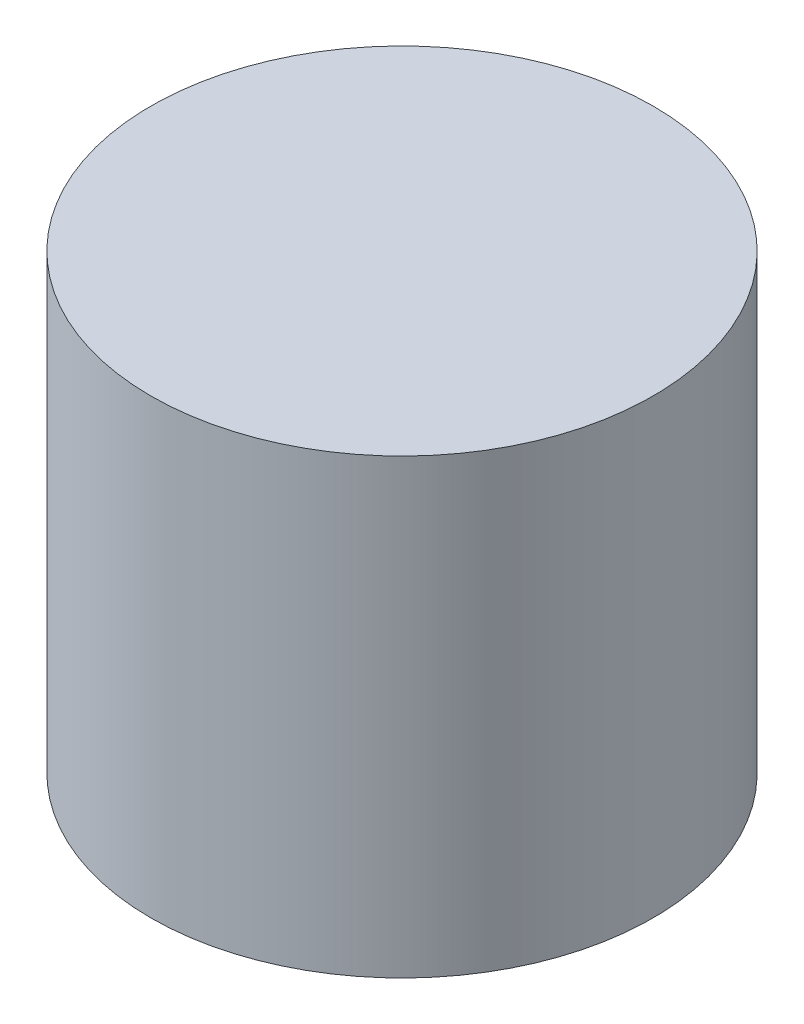
ISO-10303-21;
HEADER;
FILE_DESCRIPTION(('STEP AP214'),'2;1');
FILE_NAME('part.step','',(''),(''),'','','');
FILE_SCHEMA(('AUTOMOTIVE_DESIGN { 1 0 10303 214 1 1 1 1 }'));
ENDSEC;
DATA;
#1=APPLICATION_CONTEXT('core data for automotive mechanical design processes');
#2=APPLICATION_PROTOCOL_DEFINITION('international standard','automotive_design',2000,#1);
#3=PRODUCT_CONTEXT('',#1,'mechanical');
#4=PRODUCT('Part','Part','',(#3));
#5=PRODUCT_RELATED_PRODUCT_CATEGORY('part','',(#4));
#6=PRODUCT_DEFINITION_FORMATION('','',#4);
#7=PRODUCT_DEFINITION_CONTEXT('part definition',#1,'design');
#8=PRODUCT_DEFINITION('design','',#6,#7);
#9=PRODUCT_DEFINITION_SHAPE('','',#8);
#10=(LENGTH_UNIT() NAMED_UNIT(*) SI_UNIT(.MILLI.,.METRE.));
#11=(NAMED_UNIT(*) PLANE_ANGLE_UNIT() SI_UNIT($,.RADIAN.));
#12=(NAMED_UNIT(*) SI_UNIT($,.STERADIAN.) SOLID_ANGLE_UNIT());
#13=UNCERTAINTY_MEASURE_WITH_UNIT(LENGTH_MEASURE(1.E-05),#10,'distance_accuracy_value','');
#14=(GEOMETRIC_REPRESENTATION_CONTEXT(3) GLOBAL_UNCERTAINTY_ASSIGNED_CONTEXT((#13)) GLOBAL_UNIT_ASSIGNED_CONTEXT((#10,
#11,#12)) REPRESENTATION_CONTEXT('',''));
#15=CARTESIAN_POINT('',(0.,0.,0.));
#16=DIRECTION('',(0.,0.,1.));
#17=DIRECTION('',(1.,0.,0.));
#18=AXIS2_PLACEMENT_3D('',#15,#16,#17);
#19=CARTESIAN_POINT('',(0.,9.,0.));
#20=DIRECTION('',(0.,-1.,0.));
#21=DIRECTION('',(0.,0.,-1.));
#22=AXIS2_PLACEMENT_3D('',#19,#20,#21);
#23=CYLINDRICAL_SURFACE('',#22,5.);
#24=CARTESIAN_POINT('',(0.,9.,0.));
#25=DIRECTION('',(0.,1.,0.));
#26=DIRECTION('',(0.,0.,1.));
#27=AXIS2_PLACEMENT_3D('',#24,#25,#26);
#28=CIRCLE('',#27,5.);
#29=CARTESIAN_POINT('',(0.,9.,5.));
#30=VERTEX_POINT('',#29);
#31=EDGE_CURVE('E10',#30,#30,#28,.T.);
#32=ORIENTED_EDGE('',*,*,#31,.F.);
#33=EDGE_LOOP('',(#32));
#34=FACE_BOUND('',#33,.T.);
#35=CARTESIAN_POINT('',(0.,0.,0.));
#36=DIRECTION('',(0.,1.,0.));
#37=DIRECTION('',(0.,0.,1.));
#38=AXIS2_PLACEMENT_3D('',#35,#36,#37);
#39=CIRCLE('',#38,5.);
#40=CARTESIAN_POINT('',(0.,0.,5.));
#41=VERTEX_POINT('',#40);
#42=EDGE_CURVE('E36',#41,#41,#39,.T.);
#43=ORIENTED_EDGE('',*,*,#42,.T.);
#44=EDGE_LOOP('',(#43));
#45=FACE_BOUND('',#44,.T.);
#46=ADVANCED_FACE('F33',(#34,#45),#23,.T.);
#47=CARTESIAN_POINT('',(0.,9.,0.));
#48=DIRECTION('',(0.,1.,0.));
#49=DIRECTION('',(0.,0.,1.));
#50=AXIS2_PLACEMENT_3D('',#47,#48,#49);
#51=PLANE('',#50);
#52=ORIENTED_EDGE('',*,*,#31,.T.);
#53=EDGE_LOOP('',(#52));
#54=FACE_BOUND('',#53,.T.);
#55=ADVANCED_FACE('F48',(#54),#51,.T.);
#56=CARTESIAN_POINT('',(0.,0.,0.));
#57=DIRECTION('',(0.,1.,0.));
#58=DIRECTION('',(0.,0.,1.));
#59=AXIS2_PLACEMENT_3D('',#56,#57,#58);
#60=PLANE('',#59);
#61=ORIENTED_EDGE('',*,*,#42,.F.);
#62=EDGE_LOOP('',(#61));
#63=FACE_BOUND('',#62,.T.);
#64=ADVANCED_FACE('F46',(#63),#60,.F.);
#65=CLOSED_SHELL('',(#46,#55,#64));
#66=MANIFOLD_SOLID_BREP('B2',#65);
#67=ADVANCED_BREP_SHAPE_REPRESENTATION('',(#18,#66),#14);
#68=SHAPE_DEFINITION_REPRESENTATION(#9,#67);
ENDSEC;
END-ISO-10303-21;
